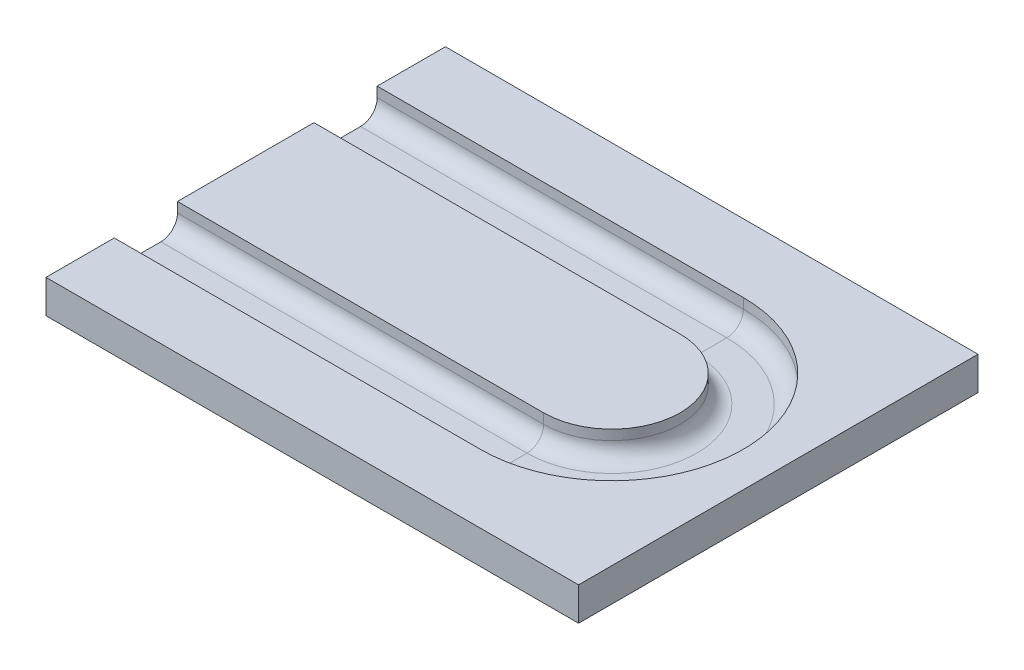
ISO-10303-21;
HEADER;
FILE_DESCRIPTION(('STEP AP214'),'2;1');
FILE_NAME('part.step','',(''),(''),'','','');
FILE_SCHEMA(('AUTOMOTIVE_DESIGN { 1 0 10303 214 1 1 1 1 }'));
ENDSEC;
DATA;
#1=APPLICATION_CONTEXT('core data for automotive mechanical design processes');
#2=APPLICATION_PROTOCOL_DEFINITION('international standard','automotive_design',2000,#1);
#3=PRODUCT_CONTEXT('',#1,'mechanical');
#4=PRODUCT('Part','Part','',(#3));
#5=PRODUCT_RELATED_PRODUCT_CATEGORY('part','',(#4));
#6=PRODUCT_DEFINITION_FORMATION('','',#4);
#7=PRODUCT_DEFINITION_CONTEXT('part definition',#1,'design');
#8=PRODUCT_DEFINITION('design','',#6,#7);
#9=PRODUCT_DEFINITION_SHAPE('','',#8);
#10=(LENGTH_UNIT() NAMED_UNIT(*) SI_UNIT(.MILLI.,.METRE.));
#11=(NAMED_UNIT(*) PLANE_ANGLE_UNIT() SI_UNIT($,.RADIAN.));
#12=(NAMED_UNIT(*) SI_UNIT($,.STERADIAN.) SOLID_ANGLE_UNIT());
#13=UNCERTAINTY_MEASURE_WITH_UNIT(LENGTH_MEASURE(1.E-05),#10,'distance_accuracy_value','');
#14=(GEOMETRIC_REPRESENTATION_CONTEXT(3) GLOBAL_UNCERTAINTY_ASSIGNED_CONTEXT((#13)) GLOBAL_UNIT_ASSIGNED_CONTEXT((#10,
#11,#12)) REPRESENTATION_CONTEXT('',''));
#15=CARTESIAN_POINT('',(0.,0.,0.));
#16=DIRECTION('',(0.,0.,1.));
#17=DIRECTION('',(1.,0.,0.));
#18=AXIS2_PLACEMENT_3D('',#15,#16,#17);
#19=CARTESIAN_POINT('',(-50.8,6.35,-38.1));
#20=DIRECTION('',(1.,0.,0.));
#21=DIRECTION('',(0.,0.,-1.));
#22=AXIS2_PLACEMENT_3D('',#19,#20,#21);
#23=PLANE('',#22);
#24=DIRECTION('',(0.,-1.,0.));
#25=VECTOR('',#24,1.);
#26=CARTESIAN_POINT('',(-50.8,4.445,25.0825));
#27=LINE('',#26,#25);
#28=CARTESIAN_POINT('',(-50.8,6.35,25.0825));
#29=VERTEX_POINT('',#28);
#30=CARTESIAN_POINT('',(-50.8,4.445,25.0825));
#31=VERTEX_POINT('',#30);
#32=EDGE_CURVE('E317',#29,#31,#27,.T.);
#33=ORIENTED_EDGE('',*,*,#32,.T.);
#34=CARTESIAN_POINT('',(-50.8,4.445,21.9075));
#35=DIRECTION('',(1.,0.,0.));
#36=DIRECTION('',(0.,0.,1.));
#37=AXIS2_PLACEMENT_3D('',#34,#35,#36);
#38=CIRCLE('',#37,3.175);
#39=CARTESIAN_POINT('',(-50.8,1.27,21.9075));
#40=VERTEX_POINT('',#39);
#41=EDGE_CURVE('E240',#31,#40,#38,.T.);
#42=ORIENTED_EDGE('',*,*,#41,.T.);
#43=DIRECTION('',(0.,0.,-1.));
#44=VECTOR('',#43,1.);
#45=CARTESIAN_POINT('',(-50.8,1.27,21.9075));
#46=LINE('',#45,#44);
#47=CARTESIAN_POINT('',(-50.8,1.27,16.1925));
#48=VERTEX_POINT('',#47);
#49=EDGE_CURVE('E244',#40,#48,#46,.T.);
#50=ORIENTED_EDGE('',*,*,#49,.T.);
#51=CARTESIAN_POINT('',(-50.8,4.445,16.1925));
#52=DIRECTION('',(1.,0.,0.));
#53=DIRECTION('',(0.,0.,-1.));
#54=AXIS2_PLACEMENT_3D('',#51,#52,#53);
#55=CIRCLE('',#54,3.175);
#56=CARTESIAN_POINT('',(-50.8,4.445,13.0175));
#57=VERTEX_POINT('',#56);
#58=EDGE_CURVE('E250',#48,#57,#55,.T.);
#59=ORIENTED_EDGE('',*,*,#58,.T.);
#60=DIRECTION('',(0.,1.,0.));
#61=VECTOR('',#60,1.);
#62=CARTESIAN_POINT('',(-50.8,6.35,13.0175));
#63=LINE('',#62,#61);
#64=CARTESIAN_POINT('',(-50.8,6.35,13.0175));
#65=VERTEX_POINT('',#64);
#66=EDGE_CURVE('E254',#57,#65,#63,.T.);
#67=ORIENTED_EDGE('',*,*,#66,.T.);
#68=DIRECTION('',(0.,0.,1.));
#69=VECTOR('',#68,1.);
#70=CARTESIAN_POINT('',(-50.8,6.35,-38.1));
#71=LINE('',#70,#69);
#72=CARTESIAN_POINT('',(-50.8,6.35,-13.0175));
#73=VERTEX_POINT('',#72);
#74=EDGE_CURVE('E267',#73,#65,#71,.T.);
#75=ORIENTED_EDGE('',*,*,#74,.F.);
#76=DIRECTION('',(0.,1.,0.));
#77=VECTOR('',#76,1.);
#78=CARTESIAN_POINT('',(-50.8,6.35,-13.0175));
#79=LINE('',#78,#77);
#80=CARTESIAN_POINT('',(-50.8,4.445,-13.0175));
#81=VERTEX_POINT('',#80);
#82=EDGE_CURVE('E61',#81,#73,#79,.T.);
#83=ORIENTED_EDGE('',*,*,#82,.F.);
#84=CARTESIAN_POINT('',(-50.8,4.445,-16.1925));
#85=DIRECTION('',(-1.,0.,0.));
#86=DIRECTION('',(0.,0.,1.));
#87=AXIS2_PLACEMENT_3D('',#84,#85,#86);
#88=CIRCLE('',#87,3.175);
#89=CARTESIAN_POINT('',(-50.8,1.27,-16.1925));
#90=VERTEX_POINT('',#89);
#91=EDGE_CURVE('E230',#90,#81,#88,.T.);
#92=ORIENTED_EDGE('',*,*,#91,.F.);
#93=DIRECTION('',(0.,0.,1.));
#94=VECTOR('',#93,1.);
#95=CARTESIAN_POINT('',(-50.8,1.27,-21.9075));
#96=LINE('',#95,#94);
#97=CARTESIAN_POINT('',(-50.8,1.27,-21.9075));
#98=VERTEX_POINT('',#97);
#99=EDGE_CURVE('E225',#98,#90,#96,.T.);
#100=ORIENTED_EDGE('',*,*,#99,.F.);
#101=CARTESIAN_POINT('',(-50.8,4.445,-21.9075));
#102=DIRECTION('',(-1.,0.,0.));
#103=DIRECTION('',(0.,0.,-1.));
#104=AXIS2_PLACEMENT_3D('',#101,#102,#103);
#105=CIRCLE('',#104,3.175);
#106=CARTESIAN_POINT('',(-50.8,4.445,-25.0825));
#107=VERTEX_POINT('',#106);
#108=EDGE_CURVE('E200',#107,#98,#105,.T.);
#109=ORIENTED_EDGE('',*,*,#108,.F.);
#110=DIRECTION('',(0.,-1.,0.));
#111=VECTOR('',#110,1.);
#112=CARTESIAN_POINT('',(-50.8,4.445,-25.0825));
#113=LINE('',#112,#111);
#114=CARTESIAN_POINT('',(-50.8,6.35,-25.0825));
#115=VERTEX_POINT('',#114);
#116=EDGE_CURVE('E208',#115,#107,#113,.T.);
#117=ORIENTED_EDGE('',*,*,#116,.F.);
#118=CARTESIAN_POINT('',(-50.8,6.35,-38.1));
#119=VERTEX_POINT('',#118);
#120=EDGE_CURVE('E262',#119,#115,#71,.T.);
#121=ORIENTED_EDGE('',*,*,#120,.F.);
#122=DIRECTION('',(0.,-1.,0.));
#123=VECTOR('',#122,1.);
#124=CARTESIAN_POINT('',(-50.8,6.35,-38.1));
#125=LINE('',#124,#123);
#126=CARTESIAN_POINT('',(-50.8,0.,-38.1));
#127=VERTEX_POINT('',#126);
#128=EDGE_CURVE('E54',#119,#127,#125,.T.);
#129=ORIENTED_EDGE('',*,*,#128,.T.);
#130=DIRECTION('',(0.,0.,1.));
#131=VECTOR('',#130,1.);
#132=CARTESIAN_POINT('',(-50.8,0.,-38.1));
#133=LINE('',#132,#131);
#134=CARTESIAN_POINT('',(-50.8,0.,38.1));
#135=VERTEX_POINT('',#134);
#136=EDGE_CURVE('E465',#127,#135,#133,.T.);
#137=ORIENTED_EDGE('',*,*,#136,.T.);
#138=DIRECTION('',(0.,-1.,0.));
#139=VECTOR('',#138,1.);
#140=CARTESIAN_POINT('',(-50.8,6.35,38.1));
#141=LINE('',#140,#139);
#142=CARTESIAN_POINT('',(-50.8,6.35,38.1));
#143=VERTEX_POINT('',#142);
#144=EDGE_CURVE('E429',#143,#135,#141,.T.);
#145=ORIENTED_EDGE('',*,*,#144,.F.);
#146=EDGE_CURVE('E268',#29,#143,#71,.T.);
#147=ORIENTED_EDGE('',*,*,#146,.F.);
#148=EDGE_LOOP('',(#33,#42,#50,#59,#67,#75,#83,#92,#100,#109,#117,#121,#129,#137,#145,#147));
#149=FACE_BOUND('',#148,.T.);
#150=ADVANCED_FACE('F45',(#149),#23,.F.);
#151=CARTESIAN_POINT('',(0.,6.35,0.));
#152=DIRECTION('',(0.,1.,0.));
#153=DIRECTION('',(0.,0.,1.));
#154=AXIS2_PLACEMENT_3D('',#151,#152,#153);
#155=PLANE('',#154);
#156=CARTESIAN_POINT('',(19.05,6.35,0.));
#157=DIRECTION('',(0.,-1.,0.));
#158=DIRECTION('',(0.,0.,-1.));
#159=AXIS2_PLACEMENT_3D('',#156,#157,#158);
#160=CIRCLE('',#159,25.0825);
#161=CARTESIAN_POINT('',(19.05,6.35,-25.0825));
#162=VERTEX_POINT('',#161);
#163=CARTESIAN_POINT('',(19.05,6.35,25.0825));
#164=VERTEX_POINT('',#163);
#165=EDGE_CURVE('E360',#162,#164,#160,.T.);
#166=ORIENTED_EDGE('',*,*,#165,.T.);
#167=DIRECTION('',(-1.,0.,0.));
#168=VECTOR('',#167,1.);
#169=CARTESIAN_POINT('',(19.05,6.35,25.0825));
#170=LINE('',#169,#168);
#171=EDGE_CURVE('E294',#164,#29,#170,.T.);
#172=ORIENTED_EDGE('',*,*,#171,.T.);
#173=ORIENTED_EDGE('',*,*,#146,.T.);
#174=DIRECTION('',(1.,0.,0.));
#175=VECTOR('',#174,1.);
#176=CARTESIAN_POINT('',(-50.8,6.35,38.1));
#177=LINE('',#176,#175);
#178=CARTESIAN_POINT('',(50.8,6.35,38.1));
#179=VERTEX_POINT('',#178);
#180=EDGE_CURVE('E70',#143,#179,#177,.T.);
#181=ORIENTED_EDGE('',*,*,#180,.T.);
#182=DIRECTION('',(0.,0.,-1.));
#183=VECTOR('',#182,1.);
#184=CARTESIAN_POINT('',(50.8,6.35,-38.1));
#185=LINE('',#184,#183);
#186=CARTESIAN_POINT('',(50.8,6.35,-38.1));
#187=VERTEX_POINT('',#186);
#188=EDGE_CURVE('E286',#179,#187,#185,.T.);
#189=ORIENTED_EDGE('',*,*,#188,.T.);
#190=DIRECTION('',(-1.,0.,0.));
#191=VECTOR('',#190,1.);
#192=CARTESIAN_POINT('',(-50.8,6.35,-38.1));
#193=LINE('',#192,#191);
#194=EDGE_CURVE('E98',#187,#119,#193,.T.);
#195=ORIENTED_EDGE('',*,*,#194,.T.);
#196=ORIENTED_EDGE('',*,*,#120,.T.);
#197=DIRECTION('',(-1.,0.,0.));
#198=VECTOR('',#197,1.);
#199=CARTESIAN_POINT('',(19.05,6.35,-25.0825));
#200=LINE('',#199,#198);
#201=EDGE_CURVE('E331',#162,#115,#200,.T.);
#202=ORIENTED_EDGE('',*,*,#201,.F.);
#203=EDGE_LOOP('',(#166,#172,#173,#181,#189,#195,#196,#202));
#204=FACE_BOUND('',#203,.T.);
#205=ADVANCED_FACE('F421',(#204),#155,.T.);
#206=ORIENTED_EDGE('',*,*,#74,.T.);
#207=DIRECTION('',(-1.,0.,0.));
#208=VECTOR('',#207,1.);
#209=CARTESIAN_POINT('',(19.05,6.35,13.0175));
#210=LINE('',#209,#208);
#211=CARTESIAN_POINT('',(19.05,6.35,13.0175));
#212=VERTEX_POINT('',#211);
#213=EDGE_CURVE('E307',#212,#65,#210,.T.);
#214=ORIENTED_EDGE('',*,*,#213,.F.);
#215=CARTESIAN_POINT('',(19.05,6.35,0.));
#216=DIRECTION('',(0.,-1.,0.));
#217=DIRECTION('',(0.,0.,-1.));
#218=AXIS2_PLACEMENT_3D('',#215,#216,#217);
#219=CIRCLE('',#218,13.0175);
#220=CARTESIAN_POINT('',(19.05,6.35,-13.0175));
#221=VERTEX_POINT('',#220);
#222=EDGE_CURVE('E356',#221,#212,#219,.T.);
#223=ORIENTED_EDGE('',*,*,#222,.F.);
#224=DIRECTION('',(-1.,0.,0.));
#225=VECTOR('',#224,1.);
#226=CARTESIAN_POINT('',(19.05,6.35,-13.0175));
#227=LINE('',#226,#225);
#228=EDGE_CURVE('E337',#221,#73,#227,.T.);
#229=ORIENTED_EDGE('',*,*,#228,.T.);
#230=EDGE_LOOP('',(#206,#214,#223,#229));
#231=FACE_BOUND('',#230,.T.);
#232=ADVANCED_FACE('F416',(#231),#155,.T.);
#233=CARTESIAN_POINT('',(50.8,6.35,-38.1));
#234=DIRECTION('',(-1.,0.,0.));
#235=DIRECTION('',(0.,0.,1.));
#236=AXIS2_PLACEMENT_3D('',#233,#234,#235);
#237=PLANE('',#236);
#238=DIRECTION('',(0.,0.,-1.));
#239=VECTOR('',#238,1.);
#240=CARTESIAN_POINT('',(50.8,0.,-38.1));
#241=LINE('',#240,#239);
#242=CARTESIAN_POINT('',(50.8,0.,38.1));
#243=VERTEX_POINT('',#242);
#244=CARTESIAN_POINT('',(50.8,0.,-38.1));
#245=VERTEX_POINT('',#244);
#246=EDGE_CURVE('E293',#243,#245,#241,.T.);
#247=ORIENTED_EDGE('',*,*,#246,.T.);
#248=DIRECTION('',(0.,-1.,0.));
#249=VECTOR('',#248,1.);
#250=CARTESIAN_POINT('',(50.8,6.35,-38.1));
#251=LINE('',#250,#249);
#252=EDGE_CURVE('E12',#187,#245,#251,.T.);
#253=ORIENTED_EDGE('',*,*,#252,.F.);
#254=ORIENTED_EDGE('',*,*,#188,.F.);
#255=DIRECTION('',(0.,-1.,0.));
#256=VECTOR('',#255,1.);
#257=CARTESIAN_POINT('',(50.8,6.35,38.1));
#258=LINE('',#257,#256);
#259=EDGE_CURVE('E463',#179,#243,#258,.T.);
#260=ORIENTED_EDGE('',*,*,#259,.T.);
#261=EDGE_LOOP('',(#247,#253,#254,#260));
#262=FACE_BOUND('',#261,.T.);
#263=ADVANCED_FACE('F47',(#262),#237,.F.);
#264=CARTESIAN_POINT('',(-50.8,6.35,-38.1));
#265=DIRECTION('',(0.,0.,1.));
#266=DIRECTION('',(1.,0.,0.));
#267=AXIS2_PLACEMENT_3D('',#264,#265,#266);
#268=PLANE('',#267);
#269=DIRECTION('',(-1.,0.,0.));
#270=VECTOR('',#269,1.);
#271=CARTESIAN_POINT('',(-50.8,0.,-38.1));
#272=LINE('',#271,#270);
#273=EDGE_CURVE('E427',#245,#127,#272,.T.);
#274=ORIENTED_EDGE('',*,*,#273,.T.);
#275=ORIENTED_EDGE('',*,*,#128,.F.);
#276=ORIENTED_EDGE('',*,*,#194,.F.);
#277=ORIENTED_EDGE('',*,*,#252,.T.);
#278=EDGE_LOOP('',(#274,#275,#276,#277));
#279=FACE_BOUND('',#278,.T.);
#280=ADVANCED_FACE('F426',(#279),#268,.F.);
#281=CARTESIAN_POINT('',(-50.8,6.35,38.1));
#282=DIRECTION('',(0.,0.,-1.));
#283=DIRECTION('',(-1.,0.,0.));
#284=AXIS2_PLACEMENT_3D('',#281,#282,#283);
#285=PLANE('',#284);
#286=DIRECTION('',(1.,0.,0.));
#287=VECTOR('',#286,1.);
#288=CARTESIAN_POINT('',(-50.8,0.,38.1));
#289=LINE('',#288,#287);
#290=EDGE_CURVE('E91',#135,#243,#289,.T.);
#291=ORIENTED_EDGE('',*,*,#290,.T.);
#292=ORIENTED_EDGE('',*,*,#259,.F.);
#293=ORIENTED_EDGE('',*,*,#180,.F.);
#294=ORIENTED_EDGE('',*,*,#144,.T.);
#295=EDGE_LOOP('',(#291,#292,#293,#294));
#296=FACE_BOUND('',#295,.T.);
#297=ADVANCED_FACE('F449',(#296),#285,.F.);
#298=CARTESIAN_POINT('',(0.,0.,0.));
#299=DIRECTION('',(0.,1.,0.));
#300=DIRECTION('',(0.,0.,1.));
#301=AXIS2_PLACEMENT_3D('',#298,#299,#300);
#302=PLANE('',#301);
#303=ORIENTED_EDGE('',*,*,#246,.F.);
#304=ORIENTED_EDGE('',*,*,#290,.F.);
#305=ORIENTED_EDGE('',*,*,#136,.F.);
#306=ORIENTED_EDGE('',*,*,#273,.F.);
#307=EDGE_LOOP('',(#303,#304,#305,#306));
#308=FACE_BOUND('',#307,.T.);
#309=ADVANCED_FACE('F456',(#308),#302,.F.);
#310=CARTESIAN_POINT('',(19.05,4.445,25.0825));
#311=DIRECTION('',(0.,0.,-1.));
#312=DIRECTION('',(-1.,0.,0.));
#313=AXIS2_PLACEMENT_3D('',#310,#311,#312);
#314=PLANE('',#313);
#315=DIRECTION('',(0.,-1.,0.));
#316=VECTOR('',#315,1.);
#317=CARTESIAN_POINT('',(19.05,4.445,25.0825));
#318=LINE('',#317,#316);
#319=CARTESIAN_POINT('',(19.05,4.445,25.0825));
#320=VERTEX_POINT('',#319);
#321=EDGE_CURVE('E182',#164,#320,#318,.T.);
#322=ORIENTED_EDGE('',*,*,#321,.T.);
#323=DIRECTION('',(-1.,0.,0.));
#324=VECTOR('',#323,1.);
#325=CARTESIAN_POINT('',(19.05,4.445,25.0825));
#326=LINE('',#325,#324);
#327=EDGE_CURVE('E289',#320,#31,#326,.T.);
#328=ORIENTED_EDGE('',*,*,#327,.T.);
#329=ORIENTED_EDGE('',*,*,#32,.F.);
#330=ORIENTED_EDGE('',*,*,#171,.F.);
#331=EDGE_LOOP('',(#322,#328,#329,#330));
#332=FACE_BOUND('',#331,.T.);
#333=ADVANCED_FACE('F476',(#332),#314,.T.);
#334=CARTESIAN_POINT('',(19.05,6.35,13.0175));
#335=DIRECTION('',(0.,0.,1.));
#336=DIRECTION('',(1.,0.,0.));
#337=AXIS2_PLACEMENT_3D('',#334,#335,#336);
#338=PLANE('',#337);
#339=DIRECTION('',(0.,1.,0.));
#340=VECTOR('',#339,1.);
#341=CARTESIAN_POINT('',(19.05,6.35,13.0175));
#342=LINE('',#341,#340);
#343=CARTESIAN_POINT('',(19.05,4.445,13.0175));
#344=VERTEX_POINT('',#343);
#345=EDGE_CURVE('E399',#344,#212,#342,.T.);
#346=ORIENTED_EDGE('',*,*,#345,.T.);
#347=ORIENTED_EDGE('',*,*,#213,.T.);
#348=ORIENTED_EDGE('',*,*,#66,.F.);
#349=DIRECTION('',(-1.,0.,0.));
#350=VECTOR('',#349,1.);
#351=CARTESIAN_POINT('',(19.05,4.445,13.0175));
#352=LINE('',#351,#350);
#353=EDGE_CURVE('E304',#344,#57,#352,.T.);
#354=ORIENTED_EDGE('',*,*,#353,.F.);
#355=EDGE_LOOP('',(#346,#347,#348,#354));
#356=FACE_BOUND('',#355,.T.);
#357=ADVANCED_FACE('F410',(#356),#338,.T.);
#358=CARTESIAN_POINT('',(19.05,4.445,16.1925));
#359=DIRECTION('',(-1.,0.,0.));
#360=DIRECTION('',(0.,0.,1.));
#361=AXIS2_PLACEMENT_3D('',#358,#359,#360);
#362=CYLINDRICAL_SURFACE('',#361,3.175);
#363=CARTESIAN_POINT('',(19.05,4.445,16.1925));
#364=DIRECTION('',(1.,0.,0.));
#365=DIRECTION('',(0.,0.,-1.));
#366=AXIS2_PLACEMENT_3D('',#363,#364,#365);
#367=CIRCLE('',#366,3.175);
#368=CARTESIAN_POINT('',(19.05,1.27,16.1925));
#369=VERTEX_POINT('',#368);
#370=EDGE_CURVE('E395',#369,#344,#367,.T.);
#371=ORIENTED_EDGE('',*,*,#370,.T.);
#372=ORIENTED_EDGE('',*,*,#353,.T.);
#373=ORIENTED_EDGE('',*,*,#58,.F.);
#374=DIRECTION('',(-1.,0.,0.));
#375=VECTOR('',#374,1.);
#376=CARTESIAN_POINT('',(19.05,1.27,16.1925));
#377=LINE('',#376,#375);
#378=EDGE_CURVE('E308',#369,#48,#377,.T.);
#379=ORIENTED_EDGE('',*,*,#378,.F.);
#380=EDGE_LOOP('',(#371,#372,#373,#379));
#381=FACE_BOUND('',#380,.T.);
#382=ADVANCED_FACE('F484',(#381),#362,.F.);
#383=CARTESIAN_POINT('',(19.05,1.27,21.9075));
#384=DIRECTION('',(0.,1.,0.));
#385=DIRECTION('',(0.,0.,1.));
#386=AXIS2_PLACEMENT_3D('',#383,#384,#385);
#387=PLANE('',#386);
#388=DIRECTION('',(0.,0.,-1.));
#389=VECTOR('',#388,1.);
#390=CARTESIAN_POINT('',(19.05,1.27,21.9075));
#391=LINE('',#390,#389);
#392=CARTESIAN_POINT('',(19.05,1.27,21.9075));
#393=VERTEX_POINT('',#392);
#394=EDGE_CURVE('E175',#393,#369,#391,.T.);
#395=ORIENTED_EDGE('',*,*,#394,.T.);
#396=ORIENTED_EDGE('',*,*,#378,.T.);
#397=ORIENTED_EDGE('',*,*,#49,.F.);
#398=DIRECTION('',(-1.,0.,0.));
#399=VECTOR('',#398,1.);
#400=CARTESIAN_POINT('',(19.05,1.27,21.9075));
#401=LINE('',#400,#399);
#402=EDGE_CURVE('E320',#393,#40,#401,.T.);
#403=ORIENTED_EDGE('',*,*,#402,.F.);
#404=EDGE_LOOP('',(#395,#396,#397,#403));
#405=FACE_BOUND('',#404,.T.);
#406=ADVANCED_FACE('F487',(#405),#387,.T.);
#407=CARTESIAN_POINT('',(19.05,4.445,21.9075));
#408=DIRECTION('',(-1.,0.,0.));
#409=DIRECTION('',(0.,0.,1.));
#410=AXIS2_PLACEMENT_3D('',#407,#408,#409);
#411=CYLINDRICAL_SURFACE('',#410,3.175);
#412=CARTESIAN_POINT('',(19.05,4.445,21.9075));
#413=DIRECTION('',(1.,0.,0.));
#414=DIRECTION('',(0.,0.,1.));
#415=AXIS2_PLACEMENT_3D('',#412,#413,#414);
#416=CIRCLE('',#415,3.175);
#417=EDGE_CURVE('E390',#320,#393,#416,.T.);
#418=ORIENTED_EDGE('',*,*,#417,.T.);
#419=ORIENTED_EDGE('',*,*,#402,.T.);
#420=ORIENTED_EDGE('',*,*,#41,.F.);
#421=ORIENTED_EDGE('',*,*,#327,.F.);
#422=EDGE_LOOP('',(#418,#419,#420,#421));
#423=FACE_BOUND('',#422,.T.);
#424=ADVANCED_FACE('F491',(#423),#411,.F.);
#425=CARTESIAN_POINT('',(19.05,6.35,0.));
#426=DIRECTION('',(0.,-1.,0.));
#427=DIRECTION('',(0.,0.,-1.));
#428=AXIS2_PLACEMENT_3D('',#425,#426,#427);
#429=CYLINDRICAL_SURFACE('',#428,25.0825);
#430=DIRECTION('',(0.,-1.,0.));
#431=VECTOR('',#430,1.);
#432=CARTESIAN_POINT('',(19.05,4.445,-25.0825));
#433=LINE('',#432,#431);
#434=CARTESIAN_POINT('',(19.05,4.445,-25.0825));
#435=VERTEX_POINT('',#434);
#436=EDGE_CURVE('E203',#162,#435,#433,.T.);
#437=ORIENTED_EDGE('',*,*,#436,.T.);
#438=CARTESIAN_POINT('',(19.05,4.445,0.));
#439=DIRECTION('',(0.,-1.,0.));
#440=DIRECTION('',(0.,0.,-1.));
#441=AXIS2_PLACEMENT_3D('',#438,#439,#440);
#442=CIRCLE('',#441,25.0825);
#443=EDGE_CURVE('E207',#435,#320,#442,.T.);
#444=ORIENTED_EDGE('',*,*,#443,.T.);
#445=ORIENTED_EDGE('',*,*,#321,.F.);
#446=ORIENTED_EDGE('',*,*,#165,.F.);
#447=EDGE_LOOP('',(#437,#444,#445,#446));
#448=FACE_BOUND('',#447,.T.);
#449=ADVANCED_FACE('F371',(#448),#429,.F.);
#450=CARTESIAN_POINT('',(19.05,6.35,0.));
#451=DIRECTION('',(0.,-1.,0.));
#452=DIRECTION('',(0.,0.,-1.));
#453=AXIS2_PLACEMENT_3D('',#450,#451,#452);
#454=CYLINDRICAL_SURFACE('',#453,13.0175);
#455=DIRECTION('',(0.,1.,0.));
#456=VECTOR('',#455,1.);
#457=CARTESIAN_POINT('',(19.05,6.35,-13.0175));
#458=LINE('',#457,#456);
#459=CARTESIAN_POINT('',(19.05,4.445,-13.0175));
#460=VERTEX_POINT('',#459);
#461=EDGE_CURVE('E375',#460,#221,#458,.T.);
#462=ORIENTED_EDGE('',*,*,#461,.T.);
#463=ORIENTED_EDGE('',*,*,#222,.T.);
#464=ORIENTED_EDGE('',*,*,#345,.F.);
#465=CARTESIAN_POINT('',(19.05,4.445,0.));
#466=DIRECTION('',(0.,-1.,0.));
#467=DIRECTION('',(0.,0.,-1.));
#468=AXIS2_PLACEMENT_3D('',#465,#466,#467);
#469=CIRCLE('',#468,13.0175);
#470=EDGE_CURVE('E351',#460,#344,#469,.T.);
#471=ORIENTED_EDGE('',*,*,#470,.F.);
#472=EDGE_LOOP('',(#462,#463,#464,#471));
#473=FACE_BOUND('',#472,.T.);
#474=ADVANCED_FACE('F413',(#473),#454,.T.);
#475=CARTESIAN_POINT('',(19.05,4.445,0.));
#476=DIRECTION('',(0.,-1.,0.));
#477=DIRECTION('',(0.,0.,-1.));
#478=AXIS2_PLACEMENT_3D('',#475,#476,#477);
#479=TOROIDAL_SURFACE('',#478,16.1925,3.175);
#480=CARTESIAN_POINT('',(19.05,4.445,-16.1925));
#481=DIRECTION('',(-1.,0.,0.));
#482=DIRECTION('',(0.,0.,1.));
#483=AXIS2_PLACEMENT_3D('',#480,#481,#482);
#484=CIRCLE('',#483,3.175);
#485=CARTESIAN_POINT('',(19.05,1.27,-16.1925));
#486=VERTEX_POINT('',#485);
#487=EDGE_CURVE('E192',#486,#460,#484,.T.);
#488=ORIENTED_EDGE('',*,*,#487,.T.);
#489=ORIENTED_EDGE('',*,*,#470,.T.);
#490=ORIENTED_EDGE('',*,*,#370,.F.);
#491=CARTESIAN_POINT('',(19.05,1.27,0.));
#492=DIRECTION('',(0.,-1.,0.));
#493=DIRECTION('',(0.,0.,-1.));
#494=AXIS2_PLACEMENT_3D('',#491,#492,#493);
#495=CIRCLE('',#494,16.1925);
#496=EDGE_CURVE('E181',#486,#369,#495,.T.);
#497=ORIENTED_EDGE('',*,*,#496,.F.);
#498=EDGE_LOOP('',(#488,#489,#490,#497));
#499=FACE_BOUND('',#498,.T.);
#500=ADVANCED_FACE('F500',(#499),#479,.F.);
#501=CARTESIAN_POINT('',(19.05,1.27,-21.9075));
#502=DIRECTION('',(0.,1.,0.));
#503=DIRECTION('',(0.,0.,1.));
#504=AXIS2_PLACEMENT_3D('',#501,#502,#503);
#505=PLANE('',#504);
#506=DIRECTION('',(0.,0.,1.));
#507=VECTOR('',#506,1.);
#508=CARTESIAN_POINT('',(19.05,1.27,-21.9075));
#509=LINE('',#508,#507);
#510=CARTESIAN_POINT('',(19.05,1.27,-21.9075));
#511=VERTEX_POINT('',#510);
#512=EDGE_CURVE('E173',#511,#486,#509,.T.);
#513=ORIENTED_EDGE('',*,*,#512,.T.);
#514=ORIENTED_EDGE('',*,*,#496,.T.);
#515=ORIENTED_EDGE('',*,*,#394,.F.);
#516=CARTESIAN_POINT('',(19.05,1.27,0.));
#517=DIRECTION('',(0.,-1.,0.));
#518=DIRECTION('',(0.,0.,-1.));
#519=AXIS2_PLACEMENT_3D('',#516,#517,#518);
#520=CIRCLE('',#519,21.9075);
#521=EDGE_CURVE('E169',#511,#393,#520,.T.);
#522=ORIENTED_EDGE('',*,*,#521,.F.);
#523=EDGE_LOOP('',(#513,#514,#515,#522));
#524=FACE_BOUND('',#523,.T.);
#525=ADVANCED_FACE('F171',(#524),#505,.T.);
#526=CARTESIAN_POINT('',(19.05,4.445,0.));
#527=DIRECTION('',(0.,-1.,0.));
#528=DIRECTION('',(0.,0.,-1.));
#529=AXIS2_PLACEMENT_3D('',#526,#527,#528);
#530=TOROIDAL_SURFACE('',#529,21.9075,3.175);
#531=CARTESIAN_POINT('',(19.05,4.445,-21.9075));
#532=DIRECTION('',(-1.,0.,0.));
#533=DIRECTION('',(0.,0.,-1.));
#534=AXIS2_PLACEMENT_3D('',#531,#532,#533);
#535=CIRCLE('',#534,3.175);
#536=EDGE_CURVE('E193',#435,#511,#535,.T.);
#537=ORIENTED_EDGE('',*,*,#536,.T.);
#538=ORIENTED_EDGE('',*,*,#521,.T.);
#539=ORIENTED_EDGE('',*,*,#417,.F.);
#540=ORIENTED_EDGE('',*,*,#443,.F.);
#541=EDGE_LOOP('',(#537,#538,#539,#540));
#542=FACE_BOUND('',#541,.T.);
#543=ADVANCED_FACE('F205',(#542),#530,.F.);
#544=CARTESIAN_POINT('',(19.05,4.445,-21.9075));
#545=DIRECTION('',(-1.,0.,0.));
#546=DIRECTION('',(0.,0.,1.));
#547=AXIS2_PLACEMENT_3D('',#544,#545,#546);
#548=CYLINDRICAL_SURFACE('',#547,3.175);
#549=ORIENTED_EDGE('',*,*,#108,.T.);
#550=DIRECTION('',(-1.,0.,0.));
#551=VECTOR('',#550,1.);
#552=CARTESIAN_POINT('',(19.05,1.27,-21.9075));
#553=LINE('',#552,#551);
#554=EDGE_CURVE('E189',#511,#98,#553,.T.);
#555=ORIENTED_EDGE('',*,*,#554,.F.);
#556=ORIENTED_EDGE('',*,*,#536,.F.);
#557=DIRECTION('',(-1.,0.,0.));
#558=VECTOR('',#557,1.);
#559=CARTESIAN_POINT('',(19.05,4.445,-25.0825));
#560=LINE('',#559,#558);
#561=EDGE_CURVE('E336',#435,#107,#560,.T.);
#562=ORIENTED_EDGE('',*,*,#561,.T.);
#563=EDGE_LOOP('',(#549,#555,#556,#562));
#564=FACE_BOUND('',#563,.T.);
#565=ADVANCED_FACE('F197',(#564),#548,.F.);
#566=CARTESIAN_POINT('',(19.05,4.445,-25.0825));
#567=DIRECTION('',(0.,0.,-1.));
#568=DIRECTION('',(-1.,0.,0.));
#569=AXIS2_PLACEMENT_3D('',#566,#567,#568);
#570=PLANE('',#569);
#571=ORIENTED_EDGE('',*,*,#116,.T.);
#572=ORIENTED_EDGE('',*,*,#561,.F.);
#573=ORIENTED_EDGE('',*,*,#436,.F.);
#574=ORIENTED_EDGE('',*,*,#201,.T.);
#575=EDGE_LOOP('',(#571,#572,#573,#574));
#576=FACE_BOUND('',#575,.T.);
#577=ADVANCED_FACE('F431',(#576),#570,.F.);
#578=CARTESIAN_POINT('',(19.05,6.35,-13.0175));
#579=DIRECTION('',(0.,0.,1.));
#580=DIRECTION('',(1.,0.,0.));
#581=AXIS2_PLACEMENT_3D('',#578,#579,#580);
#582=PLANE('',#581);
#583=ORIENTED_EDGE('',*,*,#82,.T.);
#584=ORIENTED_EDGE('',*,*,#228,.F.);
#585=ORIENTED_EDGE('',*,*,#461,.F.);
#586=DIRECTION('',(-1.,0.,0.));
#587=VECTOR('',#586,1.);
#588=CARTESIAN_POINT('',(19.05,4.445,-13.0175));
#589=LINE('',#588,#587);
#590=EDGE_CURVE('E342',#460,#81,#589,.T.);
#591=ORIENTED_EDGE('',*,*,#590,.T.);
#592=EDGE_LOOP('',(#583,#584,#585,#591));
#593=FACE_BOUND('',#592,.T.);
#594=ADVANCED_FACE('F433',(#593),#582,.F.);
#595=CARTESIAN_POINT('',(19.05,4.445,-16.1925));
#596=DIRECTION('',(-1.,0.,0.));
#597=DIRECTION('',(0.,0.,1.));
#598=AXIS2_PLACEMENT_3D('',#595,#596,#597);
#599=CYLINDRICAL_SURFACE('',#598,3.175);
#600=ORIENTED_EDGE('',*,*,#91,.T.);
#601=ORIENTED_EDGE('',*,*,#590,.F.);
#602=ORIENTED_EDGE('',*,*,#487,.F.);
#603=DIRECTION('',(-1.,0.,0.));
#604=VECTOR('',#603,1.);
#605=CARTESIAN_POINT('',(19.05,1.27,-16.1925));
#606=LINE('',#605,#604);
#607=EDGE_CURVE('E191',#486,#90,#606,.T.);
#608=ORIENTED_EDGE('',*,*,#607,.T.);
#609=EDGE_LOOP('',(#600,#601,#602,#608));
#610=FACE_BOUND('',#609,.T.);
#611=ADVANCED_FACE('F439',(#610),#599,.F.);
#612=CARTESIAN_POINT('',(19.05,1.27,-21.9075));
#613=DIRECTION('',(0.,-1.,0.));
#614=DIRECTION('',(0.,0.,-1.));
#615=AXIS2_PLACEMENT_3D('',#612,#613,#614);
#616=PLANE('',#615);
#617=ORIENTED_EDGE('',*,*,#99,.T.);
#618=ORIENTED_EDGE('',*,*,#607,.F.);
#619=ORIENTED_EDGE('',*,*,#512,.F.);
#620=ORIENTED_EDGE('',*,*,#554,.T.);
#621=EDGE_LOOP('',(#617,#618,#619,#620));
#622=FACE_BOUND('',#621,.T.);
#623=ADVANCED_FACE('F188',(#622),#616,.F.);
#624=CLOSED_SHELL('',(#150,#205,#232,#263,#280,#297,#309,#333,#357,#382,#406,#424,#449,#474,
#500,#525,#543,#565,#577,#594,#611,#623));
#625=MANIFOLD_SOLID_BREP('B2',#624);
#626=ADVANCED_BREP_SHAPE_REPRESENTATION('',(#18,#625),#14);
#627=SHAPE_DEFINITION_REPRESENTATION(#9,#626);
ENDSEC;
END-ISO-10303-21;
